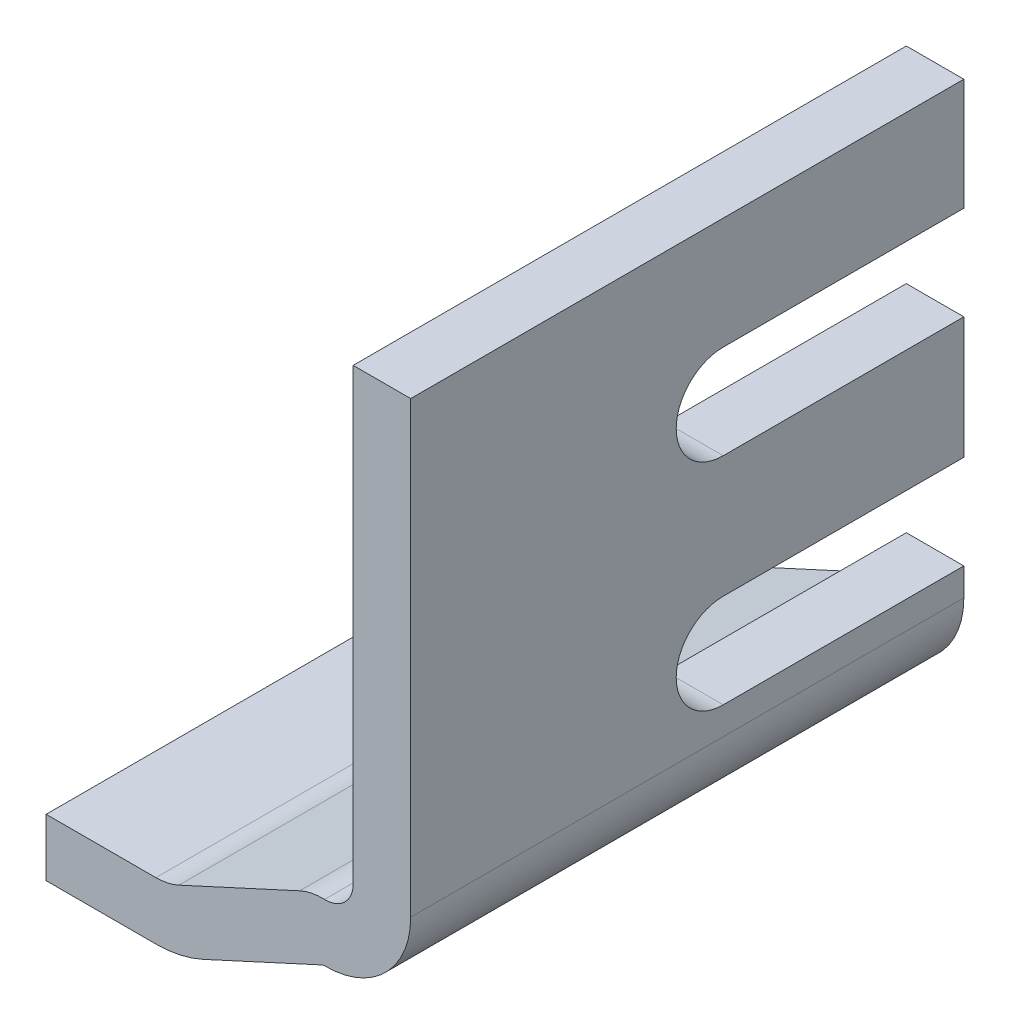
ISO-10303-21;
HEADER;
FILE_DESCRIPTION(('STEP AP214'),'2;1');
FILE_NAME('part.step','',(''),(''),'','','');
FILE_SCHEMA(('AUTOMOTIVE_DESIGN { 1 0 10303 214 1 1 1 1 }'));
ENDSEC;
DATA;
#1=APPLICATION_CONTEXT('core data for automotive mechanical design processes');
#2=APPLICATION_PROTOCOL_DEFINITION('international standard','automotive_design',2000,#1);
#3=PRODUCT_CONTEXT('',#1,'mechanical');
#4=PRODUCT('Part','Part','',(#3));
#5=PRODUCT_RELATED_PRODUCT_CATEGORY('part','',(#4));
#6=PRODUCT_DEFINITION_FORMATION('','',#4);
#7=PRODUCT_DEFINITION_CONTEXT('part definition',#1,'design');
#8=PRODUCT_DEFINITION('design','',#6,#7);
#9=PRODUCT_DEFINITION_SHAPE('','',#8);
#10=(LENGTH_UNIT() NAMED_UNIT(*) SI_UNIT(.MILLI.,.METRE.));
#11=(NAMED_UNIT(*) PLANE_ANGLE_UNIT() SI_UNIT($,.RADIAN.));
#12=(NAMED_UNIT(*) SI_UNIT($,.STERADIAN.) SOLID_ANGLE_UNIT());
#13=UNCERTAINTY_MEASURE_WITH_UNIT(LENGTH_MEASURE(1.E-05),#10,'distance_accuracy_value','');
#14=(GEOMETRIC_REPRESENTATION_CONTEXT(3) GLOBAL_UNCERTAINTY_ASSIGNED_CONTEXT((#13)) GLOBAL_UNIT_ASSIGNED_CONTEXT((#10,
#11,#12)) REPRESENTATION_CONTEXT('',''));
#15=CARTESIAN_POINT('',(0.,0.,0.));
#16=DIRECTION('',(0.,0.,1.));
#17=DIRECTION('',(1.,0.,0.));
#18=AXIS2_PLACEMENT_3D('',#15,#16,#17);
#19=CARTESIAN_POINT('',(-1.02145174439168,-1.24586231187717,1.25));
#20=DIRECTION('',(0.,-1.,0.));
#21=DIRECTION('',(1.,0.,0.));
#22=AXIS2_PLACEMENT_3D('',#19,#20,#21);
#23=PLANE('',#22);
#24=DIRECTION('',(0.,0.,-1.));
#25=VECTOR('',#24,1.);
#26=CARTESIAN_POINT('',(-1.5175,-1.24586231187717,1.25));
#27=LINE('',#26,#25);
#28=CARTESIAN_POINT('',(-1.5175,-1.24586231187717,-1.25));
#29=VERTEX_POINT('',#28);
#30=CARTESIAN_POINT('',(-1.5175,-1.24586231187717,1.25));
#31=VERTEX_POINT('',#30);
#32=EDGE_CURVE('E330',#29,#31,#27,.F.);
#33=ORIENTED_EDGE('',*,*,#32,.T.);
#34=DIRECTION('',(1.,0.,0.));
#35=VECTOR('',#34,1.);
#36=CARTESIAN_POINT('',(-1.02145174439168,-1.24586231187717,1.25));
#37=LINE('',#36,#35);
#38=CARTESIAN_POINT('',(-1.02145174439168,-1.24586231187717,1.25));
#39=VERTEX_POINT('',#38);
#40=EDGE_CURVE('E127',#39,#31,#37,.F.);
#41=ORIENTED_EDGE('',*,*,#40,.F.);
#42=DIRECTION('',(0.,0.,1.));
#43=VECTOR('',#42,1.);
#44=CARTESIAN_POINT('',(-1.02145174439168,-1.24586231187717,1.25));
#45=LINE('',#44,#43);
#46=CARTESIAN_POINT('',(-1.02145174439168,-1.24586231187717,-1.25));
#47=VERTEX_POINT('',#46);
#48=EDGE_CURVE('E271',#39,#47,#45,.F.);
#49=ORIENTED_EDGE('',*,*,#48,.T.);
#50=DIRECTION('',(1.,0.,0.));
#51=VECTOR('',#50,1.);
#52=CARTESIAN_POINT('',(-1.02145174439168,-1.24586231187717,-1.25));
#53=LINE('',#52,#51);
#54=EDGE_CURVE('E278',#29,#47,#53,.T.);
#55=ORIENTED_EDGE('',*,*,#54,.F.);
#56=EDGE_LOOP('',(#33,#41,#49,#55));
#57=FACE_BOUND('',#56,.T.);
#58=ADVANCED_FACE('F16',(#57),#23,.F.);
#59=CARTESIAN_POINT('',(-1.02145174439168,-0.995862311877173,1.25));
#60=DIRECTION('',(0.,0.,1.));
#61=DIRECTION('',(1.,0.,0.));
#62=AXIS2_PLACEMENT_3D('',#59,#60,#61);
#63=CYLINDRICAL_SURFACE('',#62,0.25);
#64=ORIENTED_EDGE('',*,*,#48,.F.);
#65=CARTESIAN_POINT('',(-1.02145174439168,-0.995862311877173,1.25));
#66=DIRECTION('',(0.,0.,1.));
#67=DIRECTION('',(1.,0.,0.));
#68=AXIS2_PLACEMENT_3D('',#65,#66,#67);
#69=CIRCLE('',#68,0.25);
#70=CARTESIAN_POINT('',(-0.917103913698397,-1.22304402379432,1.25));
#71=VERTEX_POINT('',#70);
#72=EDGE_CURVE('E19',#71,#39,#69,.F.);
#73=ORIENTED_EDGE('',*,*,#72,.F.);
#74=DIRECTION('',(0.,0.,1.));
#75=VECTOR('',#74,1.);
#76=CARTESIAN_POINT('',(-0.917103913698396,-1.22304402379432,1.25));
#77=LINE('',#76,#75);
#78=CARTESIAN_POINT('',(-0.917103913698397,-1.22304402379432,-1.25));
#79=VERTEX_POINT('',#78);
#80=EDGE_CURVE('E339',#71,#79,#77,.F.);
#81=ORIENTED_EDGE('',*,*,#80,.T.);
#82=CARTESIAN_POINT('',(-1.02145174439168,-0.995862311877173,-1.25));
#83=DIRECTION('',(0.,0.,1.));
#84=DIRECTION('',(1.,0.,0.));
#85=AXIS2_PLACEMENT_3D('',#82,#83,#84);
#86=CIRCLE('',#85,0.25);
#87=EDGE_CURVE('E272',#47,#79,#86,.T.);
#88=ORIENTED_EDGE('',*,*,#87,.F.);
#89=EDGE_LOOP('',(#64,#73,#81,#88));
#90=FACE_BOUND('',#89,.T.);
#91=ADVANCED_FACE('F262',(#90),#63,.F.);
#92=CARTESIAN_POINT('',(-1.5175,-1.24586231187717,1.25));
#93=DIRECTION('',(1.,0.,0.));
#94=DIRECTION('',(0.,0.,-1.));
#95=AXIS2_PLACEMENT_3D('',#92,#93,#94);
#96=PLANE('',#95);
#97=DIRECTION('',(0.,0.,1.));
#98=VECTOR('',#97,1.);
#99=CARTESIAN_POINT('',(-1.5175,-1.50586231187718,1.25));
#100=LINE('',#99,#98);
#101=CARTESIAN_POINT('',(-1.5175,-1.50586231187718,-1.25));
#102=VERTEX_POINT('',#101);
#103=CARTESIAN_POINT('',(-1.5175,-1.50586231187718,1.25));
#104=VERTEX_POINT('',#103);
#105=EDGE_CURVE('E349',#102,#104,#100,.T.);
#106=ORIENTED_EDGE('',*,*,#105,.T.);
#107=DIRECTION('',(0.,1.,0.));
#108=VECTOR('',#107,1.);
#109=CARTESIAN_POINT('',(-1.5175,-1.24586231187717,1.25));
#110=LINE('',#109,#108);
#111=EDGE_CURVE('E334',#31,#104,#110,.F.);
#112=ORIENTED_EDGE('',*,*,#111,.F.);
#113=ORIENTED_EDGE('',*,*,#32,.F.);
#114=DIRECTION('',(0.,1.,0.));
#115=VECTOR('',#114,1.);
#116=CARTESIAN_POINT('',(-1.5175,-1.24586231187717,-1.25));
#117=LINE('',#116,#115);
#118=EDGE_CURVE('E336',#102,#29,#117,.T.);
#119=ORIENTED_EDGE('',*,*,#118,.F.);
#120=EDGE_LOOP('',(#106,#112,#113,#119));
#121=FACE_BOUND('',#120,.T.);
#122=ADVANCED_FACE('F259',(#121),#96,.F.);
#123=CARTESIAN_POINT('',(-0.37186780509724,-0.972609230130447,1.25));
#124=DIRECTION('',(0.417391322773125,-0.908726847668595,0.));
#125=DIRECTION('',(0.908726847668595,0.417391322773125,0.));
#126=AXIS2_PLACEMENT_3D('',#123,#124,#125);
#127=PLANE('',#126);
#128=ORIENTED_EDGE('',*,*,#80,.F.);
#129=DIRECTION('',(0.908726847668595,0.417391322773125,0.));
#130=VECTOR('',#129,1.);
#131=CARTESIAN_POINT('',(-0.37186780509724,-0.972609230130447,1.25));
#132=LINE('',#131,#130);
#133=CARTESIAN_POINT('',(-0.37186780509724,-0.972609230130449,1.25));
#134=VERTEX_POINT('',#133);
#135=EDGE_CURVE('E277',#134,#71,#132,.F.);
#136=ORIENTED_EDGE('',*,*,#135,.F.);
#137=DIRECTION('',(0.,0.,1.));
#138=VECTOR('',#137,1.);
#139=CARTESIAN_POINT('',(-0.371867805097238,-0.972609230130451,1.25));
#140=LINE('',#139,#138);
#141=CARTESIAN_POINT('',(-0.37186780509724,-0.972609230130449,-1.25));
#142=VERTEX_POINT('',#141);
#143=EDGE_CURVE('E327',#142,#134,#140,.T.);
#144=ORIENTED_EDGE('',*,*,#143,.F.);
#145=DIRECTION('',(0.908726847668595,0.417391322773125,0.));
#146=VECTOR('',#145,1.);
#147=CARTESIAN_POINT('',(-0.37186780509724,-0.972609230130447,-1.25));
#148=LINE('',#147,#146);
#149=EDGE_CURVE('E341',#79,#142,#148,.T.);
#150=ORIENTED_EDGE('',*,*,#149,.F.);
#151=EDGE_LOOP('',(#128,#136,#144,#150));
#152=FACE_BOUND('',#151,.T.);
#153=ADVANCED_FACE('F255',(#152),#127,.F.);
#154=CARTESIAN_POINT('',(-1.02145174439168,-1.50586231187718,1.25));
#155=DIRECTION('',(0.,1.,0.));
#156=DIRECTION('',(-1.,0.,0.));
#157=AXIS2_PLACEMENT_3D('',#154,#155,#156);
#158=PLANE('',#157);
#159=DIRECTION('',(0.,0.,1.));
#160=VECTOR('',#159,1.);
#161=CARTESIAN_POINT('',(-1.02145174439168,-1.50586231187717,1.25));
#162=LINE('',#161,#160);
#163=CARTESIAN_POINT('',(-1.02145174439168,-1.50586231187718,1.25));
#164=VERTEX_POINT('',#163);
#165=CARTESIAN_POINT('',(-1.02145174439168,-1.50586231187718,-1.25));
#166=VERTEX_POINT('',#165);
#167=EDGE_CURVE('E320',#164,#166,#162,.F.);
#168=ORIENTED_EDGE('',*,*,#167,.F.);
#169=DIRECTION('',(-1.,0.,0.));
#170=VECTOR('',#169,1.);
#171=CARTESIAN_POINT('',(-1.02145174439168,-1.50586231187718,1.25));
#172=LINE('',#171,#170);
#173=EDGE_CURVE('E352',#104,#164,#172,.F.);
#174=ORIENTED_EDGE('',*,*,#173,.F.);
#175=ORIENTED_EDGE('',*,*,#105,.F.);
#176=DIRECTION('',(-1.,0.,0.));
#177=VECTOR('',#176,1.);
#178=CARTESIAN_POINT('',(-1.02145174439168,-1.50586231187718,-1.25));
#179=LINE('',#178,#177);
#180=EDGE_CURVE('E329',#166,#102,#179,.T.);
#181=ORIENTED_EDGE('',*,*,#180,.F.);
#182=EDGE_LOOP('',(#168,#174,#175,#181));
#183=FACE_BOUND('',#182,.T.);
#184=ADVANCED_FACE('F251',(#183),#158,.F.);
#185=CARTESIAN_POINT('',(-0.267519974403959,-1.1997909420476,1.25));
#186=DIRECTION('',(0.,0.,1.));
#187=DIRECTION('',(1.,0.,0.));
#188=AXIS2_PLACEMENT_3D('',#185,#186,#187);
#189=CYLINDRICAL_SURFACE('',#188,0.25);
#190=CARTESIAN_POINT('',(-0.267519974403959,-1.1997909420476,1.25));
#191=DIRECTION('',(0.,0.,1.));
#192=DIRECTION('',(1.,0.,0.));
#193=AXIS2_PLACEMENT_3D('',#190,#191,#192);
#194=CIRCLE('',#193,0.25);
#195=CARTESIAN_POINT('',(-0.259173324801319,-0.949930314015867,1.25));
#196=VERTEX_POINT('',#195);
#197=EDGE_CURVE('E325',#134,#196,#194,.F.);
#198=ORIENTED_EDGE('',*,*,#197,.T.);
#199=DIRECTION('',(0.,0.,1.));
#200=VECTOR('',#199,1.);
#201=CARTESIAN_POINT('',(-0.259173324801318,-0.949930314015865,1.25));
#202=LINE('',#201,#200);
#203=CARTESIAN_POINT('',(-0.259173324801319,-0.949930314015867,-1.25));
#204=VERTEX_POINT('',#203);
#205=EDGE_CURVE('E316',#196,#204,#202,.F.);
#206=ORIENTED_EDGE('',*,*,#205,.T.);
#207=CARTESIAN_POINT('',(-0.267519974403959,-1.1997909420476,-1.25));
#208=DIRECTION('',(0.,0.,1.));
#209=DIRECTION('',(1.,0.,0.));
#210=AXIS2_PLACEMENT_3D('',#207,#208,#209);
#211=CIRCLE('',#210,0.25);
#212=EDGE_CURVE('E328',#204,#142,#211,.T.);
#213=ORIENTED_EDGE('',*,*,#212,.T.);
#214=ORIENTED_EDGE('',*,*,#143,.T.);
#215=EDGE_LOOP('',(#198,#206,#213,#214));
#216=FACE_BOUND('',#215,.T.);
#217=ADVANCED_FACE('F247',(#216),#189,.T.);
#218=CARTESIAN_POINT('',(-1.02145174439168,-0.995862311877173,1.25));
#219=DIRECTION('',(0.,0.,1.));
#220=DIRECTION('',(1.,0.,0.));
#221=AXIS2_PLACEMENT_3D('',#218,#219,#220);
#222=CYLINDRICAL_SURFACE('',#221,0.51);
#223=CARTESIAN_POINT('',(-1.02145174439168,-0.995862311877173,1.25));
#224=DIRECTION('',(0.,0.,1.));
#225=DIRECTION('',(1.,0.,0.));
#226=AXIS2_PLACEMENT_3D('',#223,#224,#225);
#227=CIRCLE('',#226,0.51);
#228=CARTESIAN_POINT('',(-0.808582169777388,-1.45931300418815,1.25));
#229=VERTEX_POINT('',#228);
#230=EDGE_CURVE('E321',#229,#164,#227,.F.);
#231=ORIENTED_EDGE('',*,*,#230,.T.);
#232=ORIENTED_EDGE('',*,*,#167,.T.);
#233=CARTESIAN_POINT('',(-1.02145174439168,-0.995862311877173,-1.25));
#234=DIRECTION('',(0.,0.,1.));
#235=DIRECTION('',(1.,0.,0.));
#236=AXIS2_PLACEMENT_3D('',#233,#234,#235);
#237=CIRCLE('',#236,0.51);
#238=CARTESIAN_POINT('',(-0.808582169777383,-1.45931300418815,-1.25));
#239=VERTEX_POINT('',#238);
#240=EDGE_CURVE('E323',#166,#239,#237,.T.);
#241=ORIENTED_EDGE('',*,*,#240,.T.);
#242=DIRECTION('',(0.,0.,1.));
#243=VECTOR('',#242,1.);
#244=CARTESIAN_POINT('',(-0.808582169777388,-1.45931300418815,1.25));
#245=LINE('',#244,#243);
#246=EDGE_CURVE('E315',#239,#229,#245,.T.);
#247=ORIENTED_EDGE('',*,*,#246,.T.);
#248=EDGE_LOOP('',(#231,#232,#241,#247));
#249=FACE_BOUND('',#248,.T.);
#250=ADVANCED_FACE('F243',(#249),#222,.T.);
#251=CARTESIAN_POINT('',(-0.255,-0.825,1.25));
#252=DIRECTION('',(0.,0.,1.));
#253=DIRECTION('',(1.,0.,0.));
#254=AXIS2_PLACEMENT_3D('',#251,#252,#253);
#255=CYLINDRICAL_SURFACE('',#254,0.125);
#256=ORIENTED_EDGE('',*,*,#205,.F.);
#257=CARTESIAN_POINT('',(-0.255,-0.825,1.25));
#258=DIRECTION('',(0.,0.,1.));
#259=DIRECTION('',(1.,0.,0.));
#260=AXIS2_PLACEMENT_3D('',#257,#258,#259);
#261=CIRCLE('',#260,0.125);
#262=CARTESIAN_POINT('',(-0.129999999999998,-0.825,1.25));
#263=VERTEX_POINT('',#262);
#264=EDGE_CURVE('E317',#263,#196,#261,.F.);
#265=ORIENTED_EDGE('',*,*,#264,.F.);
#266=DIRECTION('',(0.,0.,-1.));
#267=VECTOR('',#266,1.);
#268=CARTESIAN_POINT('',(-0.129999999999998,-0.825,1.25));
#269=LINE('',#268,#267);
#270=CARTESIAN_POINT('',(-0.129999999999998,-0.825,-1.25));
#271=VERTEX_POINT('',#270);
#272=EDGE_CURVE('E387',#263,#271,#269,.T.);
#273=ORIENTED_EDGE('',*,*,#272,.T.);
#274=CARTESIAN_POINT('',(-0.255,-0.825,-1.25));
#275=DIRECTION('',(0.,0.,1.));
#276=DIRECTION('',(1.,0.,0.));
#277=AXIS2_PLACEMENT_3D('',#274,#275,#276);
#278=CIRCLE('',#277,0.125);
#279=EDGE_CURVE('E313',#204,#271,#278,.T.);
#280=ORIENTED_EDGE('',*,*,#279,.F.);
#281=EDGE_LOOP('',(#256,#265,#273,#280));
#282=FACE_BOUND('',#281,.T.);
#283=ADVANCED_FACE('F239',(#282),#255,.F.);
#284=CARTESIAN_POINT('',(-0.265477898106363,-1.20985739391529,1.25));
#285=DIRECTION('',(-0.417391322773125,0.908726847668594,0.));
#286=DIRECTION('',(-0.908726847668594,-0.417391322773125,0.));
#287=AXIS2_PLACEMENT_3D('',#284,#285,#286);
#288=PLANE('',#287);
#289=DIRECTION('',(0.,0.,1.));
#290=VECTOR('',#289,1.);
#291=CARTESIAN_POINT('',(-0.265477898106363,-1.2098573939153,1.25));
#292=LINE('',#291,#290);
#293=CARTESIAN_POINT('',(-0.265477898106369,-1.2098573939153,1.25));
#294=VERTEX_POINT('',#293);
#295=CARTESIAN_POINT('',(-0.265477898106369,-1.2098573939153,-1.25));
#296=VERTEX_POINT('',#295);
#297=EDGE_CURVE('E300',#294,#296,#292,.F.);
#298=ORIENTED_EDGE('',*,*,#297,.F.);
#299=DIRECTION('',(-0.908726847668594,-0.417391322773125,0.));
#300=VECTOR('',#299,1.);
#301=CARTESIAN_POINT('',(-0.265477898106363,-1.20985739391529,1.25));
#302=LINE('',#301,#300);
#303=EDGE_CURVE('E382',#229,#294,#302,.F.);
#304=ORIENTED_EDGE('',*,*,#303,.F.);
#305=ORIENTED_EDGE('',*,*,#246,.F.);
#306=DIRECTION('',(-0.908726847668589,-0.417391322773138,0.));
#307=VECTOR('',#306,1.);
#308=CARTESIAN_POINT('',(-0.265477898106363,-1.20985739391529,-1.25));
#309=LINE('',#308,#307);
#310=EDGE_CURVE('E303',#296,#239,#309,.T.);
#311=ORIENTED_EDGE('',*,*,#310,.F.);
#312=EDGE_LOOP('',(#298,#304,#305,#311));
#313=FACE_BOUND('',#312,.T.);
#314=ADVANCED_FACE('F235',(#313),#288,.F.);
#315=CARTESIAN_POINT('',(-0.129999999999998,0.825,1.25));
#316=DIRECTION('',(1.,0.,0.));
#317=DIRECTION('',(0.,0.,-1.));
#318=AXIS2_PLACEMENT_3D('',#315,#316,#317);
#319=PLANE('',#318);
#320=CARTESIAN_POINT('',(-0.129999999999998,0.4875,-0.1625));
#321=DIRECTION('',(-1.,0.,0.));
#322=DIRECTION('',(0.,0.,1.));
#323=AXIS2_PLACEMENT_3D('',#320,#321,#322);
#324=CIRCLE('',#323,0.2125);
#325=CARTESIAN_POINT('',(-0.129999999999998,0.275,-0.1625));
#326=VERTEX_POINT('',#325);
#327=CARTESIAN_POINT('',(-0.129999999999998,0.7,-0.1625));
#328=VERTEX_POINT('',#327);
#329=EDGE_CURVE('E308',#326,#328,#324,.T.);
#330=ORIENTED_EDGE('',*,*,#329,.F.);
#331=DIRECTION('',(0.,0.,-1.));
#332=VECTOR('',#331,1.);
#333=CARTESIAN_POINT('',(-0.129999999999998,0.275,1.25));
#334=LINE('',#333,#332);
#335=CARTESIAN_POINT('',(-0.129999999999998,0.275,-1.25));
#336=VERTEX_POINT('',#335);
#337=EDGE_CURVE('E312',#336,#326,#334,.F.);
#338=ORIENTED_EDGE('',*,*,#337,.F.);
#339=DIRECTION('',(0.,1.,0.));
#340=VECTOR('',#339,1.);
#341=CARTESIAN_POINT('',(-0.129999999999998,-0.825,-1.25));
#342=LINE('',#341,#340);
#343=CARTESIAN_POINT('',(-0.129999999999998,-0.275,-1.25));
#344=VERTEX_POINT('',#343);
#345=EDGE_CURVE('E180',#344,#336,#342,.T.);
#346=ORIENTED_EDGE('',*,*,#345,.F.);
#347=DIRECTION('',(0.,0.,1.));
#348=VECTOR('',#347,1.);
#349=CARTESIAN_POINT('',(-0.129999999999998,-0.275,0.05));
#350=LINE('',#349,#348);
#351=CARTESIAN_POINT('',(-0.129999999999998,-0.275,-0.1625));
#352=VERTEX_POINT('',#351);
#353=EDGE_CURVE('E371',#344,#352,#350,.T.);
#354=ORIENTED_EDGE('',*,*,#353,.T.);
#355=CARTESIAN_POINT('',(-0.129999999999998,-0.4875,-0.1625));
#356=DIRECTION('',(-1.,0.,0.));
#357=DIRECTION('',(0.,0.,1.));
#358=AXIS2_PLACEMENT_3D('',#355,#356,#357);
#359=CIRCLE('',#358,0.2125);
#360=CARTESIAN_POINT('',(-0.129999999999998,-0.7,-0.1625));
#361=VERTEX_POINT('',#360);
#362=EDGE_CURVE('E304',#352,#361,#359,.F.);
#363=ORIENTED_EDGE('',*,*,#362,.T.);
#364=DIRECTION('',(0.,0.,-1.));
#365=VECTOR('',#364,1.);
#366=CARTESIAN_POINT('',(-0.129999999999998,-0.7,-1.25));
#367=LINE('',#366,#365);
#368=CARTESIAN_POINT('',(-0.129999999999998,-0.7,-1.25));
#369=VERTEX_POINT('',#368);
#370=EDGE_CURVE('E376',#361,#369,#367,.T.);
#371=ORIENTED_EDGE('',*,*,#370,.T.);
#372=DIRECTION('',(0.,1.,0.));
#373=VECTOR('',#372,1.);
#374=CARTESIAN_POINT('',(-0.129999999999998,-0.825,-1.25));
#375=LINE('',#374,#373);
#376=EDGE_CURVE('E379',#271,#369,#375,.T.);
#377=ORIENTED_EDGE('',*,*,#376,.F.);
#378=ORIENTED_EDGE('',*,*,#272,.F.);
#379=DIRECTION('',(0.,1.,0.));
#380=VECTOR('',#379,1.);
#381=CARTESIAN_POINT('',(-0.129999999999998,-0.825,1.25));
#382=LINE('',#381,#380);
#383=CARTESIAN_POINT('',(-0.129999999999999,1.205,1.25));
#384=VERTEX_POINT('',#383);
#385=EDGE_CURVE('E299',#263,#384,#382,.T.);
#386=ORIENTED_EDGE('',*,*,#385,.T.);
#387=DIRECTION('',(0.,0.,1.));
#388=VECTOR('',#387,1.);
#389=CARTESIAN_POINT('',(-0.13,1.205,1.25));
#390=LINE('',#389,#388);
#391=CARTESIAN_POINT('',(-0.129999999999999,1.205,-1.25));
#392=VERTEX_POINT('',#391);
#393=EDGE_CURVE('E402',#392,#384,#390,.T.);
#394=ORIENTED_EDGE('',*,*,#393,.F.);
#395=DIRECTION('',(0.,1.,0.));
#396=VECTOR('',#395,1.);
#397=CARTESIAN_POINT('',(-0.129999999999998,0.825,-1.25));
#398=LINE('',#397,#396);
#399=CARTESIAN_POINT('',(-0.129999999999998,0.7,-1.25));
#400=VERTEX_POINT('',#399);
#401=EDGE_CURVE('E384',#400,#392,#398,.T.);
#402=ORIENTED_EDGE('',*,*,#401,.F.);
#403=DIRECTION('',(0.,0.,-1.));
#404=VECTOR('',#403,1.);
#405=CARTESIAN_POINT('',(-0.129999999999998,0.7,1.25));
#406=LINE('',#405,#404);
#407=EDGE_CURVE('E311',#328,#400,#406,.T.);
#408=ORIENTED_EDGE('',*,*,#407,.F.);
#409=EDGE_LOOP('',(#330,#338,#346,#354,#363,#371,#377,#378,#386,#394,#402,#408));
#410=FACE_BOUND('',#409,.T.);
#411=ADVANCED_FACE('F232',(#410),#319,.F.);
#412=CARTESIAN_POINT('',(-0.255,-0.825,-1.25));
#413=DIRECTION('',(0.,0.,-1.));
#414=DIRECTION('',(-1.,0.,0.));
#415=AXIS2_PLACEMENT_3D('',#412,#413,#414);
#416=PLANE('',#415);
#417=DIRECTION('',(0.,1.,0.));
#418=VECTOR('',#417,1.);
#419=CARTESIAN_POINT('',(0.130000000000002,0.825,-1.25));
#420=LINE('',#419,#418);
#421=CARTESIAN_POINT('',(0.130000000000002,0.275,-1.25));
#422=VERTEX_POINT('',#421);
#423=CARTESIAN_POINT('',(0.130000000000002,-0.275,-1.25));
#424=VERTEX_POINT('',#423);
#425=EDGE_CURVE('E165',#422,#424,#420,.F.);
#426=ORIENTED_EDGE('',*,*,#425,.T.);
#427=DIRECTION('',(1.,0.,0.));
#428=VECTOR('',#427,1.);
#429=CARTESIAN_POINT('',(3.79436099586339,-0.275,-1.25));
#430=LINE('',#429,#428);
#431=EDGE_CURVE('E373',#424,#344,#430,.F.);
#432=ORIENTED_EDGE('',*,*,#431,.T.);
#433=ORIENTED_EDGE('',*,*,#345,.T.);
#434=DIRECTION('',(1.,0.,0.));
#435=VECTOR('',#434,1.);
#436=CARTESIAN_POINT('',(3.79436099586339,0.275,-1.25));
#437=LINE('',#436,#435);
#438=EDGE_CURVE('E175',#422,#336,#437,.F.);
#439=ORIENTED_EDGE('',*,*,#438,.F.);
#440=EDGE_LOOP('',(#426,#432,#433,#439));
#441=FACE_BOUND('',#440,.T.);
#442=ADVANCED_FACE('F179',(#441),#416,.T.);
#443=CARTESIAN_POINT('',(3.79436099586339,-0.275,0.05));
#444=DIRECTION('',(0.,1.,0.));
#445=DIRECTION('',(0.,0.,1.));
#446=AXIS2_PLACEMENT_3D('',#443,#444,#445);
#447=PLANE('',#446);
#448=DIRECTION('',(-1.,0.,0.));
#449=VECTOR('',#448,1.);
#450=CARTESIAN_POINT('',(3.79436099586339,-0.275,-0.1625));
#451=LINE('',#450,#449);
#452=CARTESIAN_POINT('',(0.130000000000002,-0.275,-0.1625));
#453=VERTEX_POINT('',#452);
#454=EDGE_CURVE('E307',#453,#352,#451,.T.);
#455=ORIENTED_EDGE('',*,*,#454,.T.);
#456=ORIENTED_EDGE('',*,*,#353,.F.);
#457=ORIENTED_EDGE('',*,*,#431,.F.);
#458=DIRECTION('',(0.,0.,1.));
#459=VECTOR('',#458,1.);
#460=CARTESIAN_POINT('',(0.130000000000002,-0.275,1.25));
#461=LINE('',#460,#459);
#462=EDGE_CURVE('E172',#424,#453,#461,.T.);
#463=ORIENTED_EDGE('',*,*,#462,.T.);
#464=EDGE_LOOP('',(#455,#456,#457,#463));
#465=FACE_BOUND('',#464,.T.);
#466=ADVANCED_FACE('F225',(#465),#447,.F.);
#467=CARTESIAN_POINT('',(3.79436099586339,-0.4875,-0.1625));
#468=DIRECTION('',(-1.,0.,0.));
#469=DIRECTION('',(0.,0.,1.));
#470=AXIS2_PLACEMENT_3D('',#467,#468,#469);
#471=CYLINDRICAL_SURFACE('',#470,0.2125);
#472=DIRECTION('',(1.,0.,0.));
#473=VECTOR('',#472,1.);
#474=CARTESIAN_POINT('',(3.79436099586339,-0.7,-0.1625));
#475=LINE('',#474,#473);
#476=CARTESIAN_POINT('',(0.130000000000002,-0.7,-0.1625));
#477=VERTEX_POINT('',#476);
#478=EDGE_CURVE('E306',#477,#361,#475,.F.);
#479=ORIENTED_EDGE('',*,*,#478,.T.);
#480=ORIENTED_EDGE('',*,*,#362,.F.);
#481=ORIENTED_EDGE('',*,*,#454,.F.);
#482=CARTESIAN_POINT('',(0.130000000000002,-0.4875,-0.1625));
#483=DIRECTION('',(-1.,0.,0.));
#484=DIRECTION('',(0.,0.,1.));
#485=AXIS2_PLACEMENT_3D('',#482,#483,#484);
#486=CIRCLE('',#485,0.2125);
#487=EDGE_CURVE('E292',#453,#477,#486,.F.);
#488=ORIENTED_EDGE('',*,*,#487,.T.);
#489=EDGE_LOOP('',(#479,#480,#481,#488));
#490=FACE_BOUND('',#489,.T.);
#491=ADVANCED_FACE('F221',(#490),#471,.F.);
#492=CARTESIAN_POINT('',(3.79436099586339,-0.7,-1.25));
#493=DIRECTION('',(0.,-1.,0.));
#494=DIRECTION('',(0.,0.,-1.));
#495=AXIS2_PLACEMENT_3D('',#492,#493,#494);
#496=PLANE('',#495);
#497=ORIENTED_EDGE('',*,*,#478,.F.);
#498=DIRECTION('',(0.,0.,1.));
#499=VECTOR('',#498,1.);
#500=CARTESIAN_POINT('',(0.130000000000002,-0.7,1.25));
#501=LINE('',#500,#499);
#502=CARTESIAN_POINT('',(0.130000000000002,-0.7,-1.25));
#503=VERTEX_POINT('',#502);
#504=EDGE_CURVE('E295',#477,#503,#501,.F.);
#505=ORIENTED_EDGE('',*,*,#504,.T.);
#506=DIRECTION('',(-1.,0.,0.));
#507=VECTOR('',#506,1.);
#508=CARTESIAN_POINT('',(-0.255,-0.7,-1.25));
#509=LINE('',#508,#507);
#510=EDGE_CURVE('E419',#369,#503,#509,.F.);
#511=ORIENTED_EDGE('',*,*,#510,.F.);
#512=ORIENTED_EDGE('',*,*,#370,.F.);
#513=EDGE_LOOP('',(#497,#505,#511,#512));
#514=FACE_BOUND('',#513,.T.);
#515=ADVANCED_FACE('F217',(#514),#496,.F.);
#516=CARTESIAN_POINT('',(-0.255,-0.825,-1.25));
#517=DIRECTION('',(0.,0.,-1.));
#518=DIRECTION('',(-1.,0.,0.));
#519=AXIS2_PLACEMENT_3D('',#516,#517,#518);
#520=PLANE('',#519);
#521=ORIENTED_EDGE('',*,*,#212,.F.);
#522=ORIENTED_EDGE('',*,*,#279,.T.);
#523=ORIENTED_EDGE('',*,*,#376,.T.);
#524=ORIENTED_EDGE('',*,*,#510,.T.);
#525=DIRECTION('',(0.,1.,0.));
#526=VECTOR('',#525,1.);
#527=CARTESIAN_POINT('',(0.130000000000002,0.825,-1.25));
#528=LINE('',#527,#526);
#529=CARTESIAN_POINT('',(0.130000000000002,-0.825,-1.25));
#530=VERTEX_POINT('',#529);
#531=EDGE_CURVE('E428',#503,#530,#528,.F.);
#532=ORIENTED_EDGE('',*,*,#531,.T.);
#533=CARTESIAN_POINT('',(-0.255,-0.825,-1.25));
#534=DIRECTION('',(0.,0.,1.));
#535=DIRECTION('',(1.,0.,0.));
#536=AXIS2_PLACEMENT_3D('',#533,#534,#535);
#537=CIRCLE('',#536,0.385);
#538=EDGE_CURVE('E301',#296,#530,#537,.T.);
#539=ORIENTED_EDGE('',*,*,#538,.F.);
#540=ORIENTED_EDGE('',*,*,#310,.T.);
#541=ORIENTED_EDGE('',*,*,#240,.F.);
#542=ORIENTED_EDGE('',*,*,#180,.T.);
#543=ORIENTED_EDGE('',*,*,#118,.T.);
#544=ORIENTED_EDGE('',*,*,#54,.T.);
#545=ORIENTED_EDGE('',*,*,#87,.T.);
#546=ORIENTED_EDGE('',*,*,#149,.T.);
#547=EDGE_LOOP('',(#521,#522,#523,#524,#532,#539,#540,#541,#542,#543,#544,#545,#546));
#548=FACE_BOUND('',#547,.T.);
#549=ADVANCED_FACE('F213',(#548),#520,.T.);
#550=CARTESIAN_POINT('',(-0.255,-0.825,1.25));
#551=DIRECTION('',(0.,0.,1.));
#552=DIRECTION('',(1.,0.,0.));
#553=AXIS2_PLACEMENT_3D('',#550,#551,#552);
#554=CYLINDRICAL_SURFACE('',#553,0.385);
#555=CARTESIAN_POINT('',(-0.255,-0.825,1.25));
#556=DIRECTION('',(0.,0.,1.));
#557=DIRECTION('',(1.,0.,0.));
#558=AXIS2_PLACEMENT_3D('',#555,#556,#557);
#559=CIRCLE('',#558,0.385);
#560=CARTESIAN_POINT('',(0.130000000000002,-0.825,1.25));
#561=VERTEX_POINT('',#560);
#562=EDGE_CURVE('E296',#561,#294,#559,.F.);
#563=ORIENTED_EDGE('',*,*,#562,.T.);
#564=ORIENTED_EDGE('',*,*,#297,.T.);
#565=ORIENTED_EDGE('',*,*,#538,.T.);
#566=DIRECTION('',(0.,0.,1.));
#567=VECTOR('',#566,1.);
#568=CARTESIAN_POINT('',(0.130000000000002,-0.825,1.25));
#569=LINE('',#568,#567);
#570=EDGE_CURVE('E431',#530,#561,#569,.T.);
#571=ORIENTED_EDGE('',*,*,#570,.T.);
#572=EDGE_LOOP('',(#563,#564,#565,#571));
#573=FACE_BOUND('',#572,.T.);
#574=ADVANCED_FACE('F210',(#573),#554,.T.);
#575=CARTESIAN_POINT('',(-0.255,-0.825,1.25));
#576=DIRECTION('',(0.,0.,-1.));
#577=DIRECTION('',(-1.,0.,0.));
#578=AXIS2_PLACEMENT_3D('',#575,#576,#577);
#579=PLANE('',#578);
#580=DIRECTION('',(1.,0.,0.));
#581=VECTOR('',#580,1.);
#582=CARTESIAN_POINT('',(0.130000000000002,1.205,1.25));
#583=LINE('',#582,#581);
#584=CARTESIAN_POINT('',(0.130000000000002,1.205,1.25));
#585=VERTEX_POINT('',#584);
#586=EDGE_CURVE('E406',#384,#585,#583,.T.);
#587=ORIENTED_EDGE('',*,*,#586,.F.);
#588=ORIENTED_EDGE('',*,*,#385,.F.);
#589=ORIENTED_EDGE('',*,*,#264,.T.);
#590=ORIENTED_EDGE('',*,*,#197,.F.);
#591=ORIENTED_EDGE('',*,*,#135,.T.);
#592=ORIENTED_EDGE('',*,*,#72,.T.);
#593=ORIENTED_EDGE('',*,*,#40,.T.);
#594=ORIENTED_EDGE('',*,*,#111,.T.);
#595=ORIENTED_EDGE('',*,*,#173,.T.);
#596=ORIENTED_EDGE('',*,*,#230,.F.);
#597=ORIENTED_EDGE('',*,*,#303,.T.);
#598=ORIENTED_EDGE('',*,*,#562,.F.);
#599=DIRECTION('',(0.,1.,0.));
#600=VECTOR('',#599,1.);
#601=CARTESIAN_POINT('',(0.130000000000002,0.825,1.25));
#602=LINE('',#601,#600);
#603=EDGE_CURVE('E434',#561,#585,#602,.T.);
#604=ORIENTED_EDGE('',*,*,#603,.T.);
#605=EDGE_LOOP('',(#587,#588,#589,#590,#591,#592,#593,#594,#595,#596,#597,#598,#604));
#606=FACE_BOUND('',#605,.T.);
#607=ADVANCED_FACE('F206',(#606),#579,.F.);
#608=CARTESIAN_POINT('',(0.130000000000002,1.205,1.25));
#609=DIRECTION('',(0.,1.,0.));
#610=DIRECTION('',(0.,0.,1.));
#611=AXIS2_PLACEMENT_3D('',#608,#609,#610);
#612=PLANE('',#611);
#613=DIRECTION('',(-1.,0.,0.));
#614=VECTOR('',#613,1.);
#615=CARTESIAN_POINT('',(-0.255,1.205,-1.25));
#616=LINE('',#615,#614);
#617=CARTESIAN_POINT('',(0.130000000000002,1.205,-1.25));
#618=VERTEX_POINT('',#617);
#619=EDGE_CURVE('E405',#392,#618,#616,.F.);
#620=ORIENTED_EDGE('',*,*,#619,.F.);
#621=ORIENTED_EDGE('',*,*,#393,.T.);
#622=ORIENTED_EDGE('',*,*,#586,.T.);
#623=DIRECTION('',(0.,0.,1.));
#624=VECTOR('',#623,1.);
#625=CARTESIAN_POINT('',(0.130000000000002,1.205,1.25));
#626=LINE('',#625,#624);
#627=EDGE_CURVE('E442',#585,#618,#626,.F.);
#628=ORIENTED_EDGE('',*,*,#627,.T.);
#629=EDGE_LOOP('',(#620,#621,#622,#628));
#630=FACE_BOUND('',#629,.T.);
#631=ADVANCED_FACE('F202',(#630),#612,.T.);
#632=CARTESIAN_POINT('',(-0.255,-0.825,-1.25));
#633=DIRECTION('',(0.,0.,-1.));
#634=DIRECTION('',(-1.,0.,0.));
#635=AXIS2_PLACEMENT_3D('',#632,#633,#634);
#636=PLANE('',#635);
#637=ORIENTED_EDGE('',*,*,#619,.T.);
#638=DIRECTION('',(0.,1.,0.));
#639=VECTOR('',#638,1.);
#640=CARTESIAN_POINT('',(0.130000000000002,0.825,-1.25));
#641=LINE('',#640,#639);
#642=CARTESIAN_POINT('',(0.130000000000002,0.7,-1.25));
#643=VERTEX_POINT('',#642);
#644=EDGE_CURVE('E450',#618,#643,#641,.F.);
#645=ORIENTED_EDGE('',*,*,#644,.T.);
#646=DIRECTION('',(1.,0.,0.));
#647=VECTOR('',#646,1.);
#648=CARTESIAN_POINT('',(3.79436099586339,0.7,-1.25));
#649=LINE('',#648,#647);
#650=EDGE_CURVE('E454',#400,#643,#649,.T.);
#651=ORIENTED_EDGE('',*,*,#650,.F.);
#652=ORIENTED_EDGE('',*,*,#401,.T.);
#653=EDGE_LOOP('',(#637,#645,#651,#652));
#654=FACE_BOUND('',#653,.T.);
#655=ADVANCED_FACE('F198',(#654),#636,.T.);
#656=CARTESIAN_POINT('',(3.79436099586339,0.7,-1.25));
#657=DIRECTION('',(0.,-1.,0.));
#658=DIRECTION('',(0.,0.,-1.));
#659=AXIS2_PLACEMENT_3D('',#656,#657,#658);
#660=PLANE('',#659);
#661=ORIENTED_EDGE('',*,*,#407,.T.);
#662=ORIENTED_EDGE('',*,*,#650,.T.);
#663=DIRECTION('',(0.,0.,1.));
#664=VECTOR('',#663,1.);
#665=CARTESIAN_POINT('',(0.130000000000002,0.7,1.25));
#666=LINE('',#665,#664);
#667=CARTESIAN_POINT('',(0.130000000000002,0.7,-0.1625));
#668=VERTEX_POINT('',#667);
#669=EDGE_CURVE('E291',#643,#668,#666,.T.);
#670=ORIENTED_EDGE('',*,*,#669,.T.);
#671=DIRECTION('',(-1.,0.,0.));
#672=VECTOR('',#671,1.);
#673=CARTESIAN_POINT('',(3.79436099586339,0.7,-0.1625));
#674=LINE('',#673,#672);
#675=EDGE_CURVE('E462',#668,#328,#674,.T.);
#676=ORIENTED_EDGE('',*,*,#675,.T.);
#677=EDGE_LOOP('',(#661,#662,#670,#676));
#678=FACE_BOUND('',#677,.T.);
#679=ADVANCED_FACE('F192',(#678),#660,.T.);
#680=CARTESIAN_POINT('',(3.79436099586339,0.4875,-0.1625));
#681=DIRECTION('',(-1.,0.,0.));
#682=DIRECTION('',(0.,0.,1.));
#683=AXIS2_PLACEMENT_3D('',#680,#681,#682);
#684=CYLINDRICAL_SURFACE('',#683,0.2125);
#685=DIRECTION('',(1.,0.,0.));
#686=VECTOR('',#685,1.);
#687=CARTESIAN_POINT('',(3.79436099586339,0.275,-0.1625));
#688=LINE('',#687,#686);
#689=CARTESIAN_POINT('',(0.130000000000002,0.275,-0.1625));
#690=VERTEX_POINT('',#689);
#691=EDGE_CURVE('E33',#326,#690,#688,.T.);
#692=ORIENTED_EDGE('',*,*,#691,.F.);
#693=ORIENTED_EDGE('',*,*,#329,.T.);
#694=ORIENTED_EDGE('',*,*,#675,.F.);
#695=CARTESIAN_POINT('',(0.130000000000002,0.4875,-0.1625));
#696=DIRECTION('',(-1.,0.,0.));
#697=DIRECTION('',(0.,0.,1.));
#698=AXIS2_PLACEMENT_3D('',#695,#696,#697);
#699=CIRCLE('',#698,0.2125);
#700=EDGE_CURVE('E25',#668,#690,#699,.F.);
#701=ORIENTED_EDGE('',*,*,#700,.T.);
#702=EDGE_LOOP('',(#692,#693,#694,#701));
#703=FACE_BOUND('',#702,.T.);
#704=ADVANCED_FACE('F184',(#703),#684,.F.);
#705=CARTESIAN_POINT('',(3.79436099586339,0.275,0.05));
#706=DIRECTION('',(0.,1.,0.));
#707=DIRECTION('',(0.,0.,1.));
#708=AXIS2_PLACEMENT_3D('',#705,#706,#707);
#709=PLANE('',#708);
#710=DIRECTION('',(0.,0.,1.));
#711=VECTOR('',#710,1.);
#712=CARTESIAN_POINT('',(0.130000000000002,0.275,1.25));
#713=LINE('',#712,#711);
#714=EDGE_CURVE('E11',#690,#422,#713,.F.);
#715=ORIENTED_EDGE('',*,*,#714,.T.);
#716=ORIENTED_EDGE('',*,*,#438,.T.);
#717=ORIENTED_EDGE('',*,*,#337,.T.);
#718=ORIENTED_EDGE('',*,*,#691,.T.);
#719=EDGE_LOOP('',(#715,#716,#717,#718));
#720=FACE_BOUND('',#719,.T.);
#721=ADVANCED_FACE('F182',(#720),#709,.T.);
#722=CARTESIAN_POINT('',(0.130000000000002,0.825,1.25));
#723=DIRECTION('',(-1.,0.,0.));
#724=DIRECTION('',(0.,0.,1.));
#725=AXIS2_PLACEMENT_3D('',#722,#723,#724);
#726=PLANE('',#725);
#727=ORIENTED_EDGE('',*,*,#700,.F.);
#728=ORIENTED_EDGE('',*,*,#669,.F.);
#729=ORIENTED_EDGE('',*,*,#644,.F.);
#730=ORIENTED_EDGE('',*,*,#627,.F.);
#731=ORIENTED_EDGE('',*,*,#603,.F.);
#732=ORIENTED_EDGE('',*,*,#570,.F.);
#733=ORIENTED_EDGE('',*,*,#531,.F.);
#734=ORIENTED_EDGE('',*,*,#504,.F.);
#735=ORIENTED_EDGE('',*,*,#487,.F.);
#736=ORIENTED_EDGE('',*,*,#462,.F.);
#737=ORIENTED_EDGE('',*,*,#425,.F.);
#738=ORIENTED_EDGE('',*,*,#714,.F.);
#739=EDGE_LOOP('',(#727,#728,#729,#730,#731,#732,#733,#734,#735,#736,#737,#738));
#740=FACE_BOUND('',#739,.T.);
#741=ADVANCED_FACE('F168',(#740),#726,.F.);
#742=CLOSED_SHELL('',(#58,#91,#122,#153,#184,#217,#250,#283,#314,#411,#442,#466,#491,#515,#549,
#574,#607,#631,#655,#679,#704,#721,#741));
#743=MANIFOLD_SOLID_BREP('B1',#742);
#744=ADVANCED_BREP_SHAPE_REPRESENTATION('',(#18,#743),#14);
#745=SHAPE_DEFINITION_REPRESENTATION(#9,#744);
ENDSEC;
END-ISO-10303-21;
